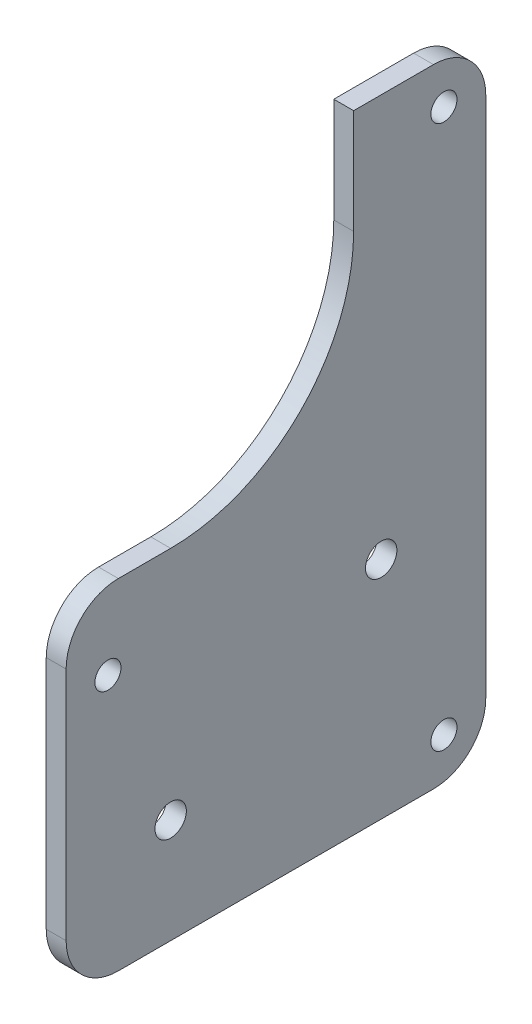
ISO-10303-21;
HEADER;
FILE_DESCRIPTION(('STEP AP214'),'2;1');
FILE_NAME('part.step','',(''),(''),'','','');
FILE_SCHEMA(('AUTOMOTIVE_DESIGN { 1 0 10303 214 1 1 1 1 }'));
ENDSEC;
DATA;
#1=APPLICATION_CONTEXT('core data for automotive mechanical design processes');
#2=APPLICATION_PROTOCOL_DEFINITION('international standard','automotive_design',2000,#1);
#3=PRODUCT_CONTEXT('',#1,'mechanical');
#4=PRODUCT('Part','Part','',(#3));
#5=PRODUCT_RELATED_PRODUCT_CATEGORY('part','',(#4));
#6=PRODUCT_DEFINITION_FORMATION('','',#4);
#7=PRODUCT_DEFINITION_CONTEXT('part definition',#1,'design');
#8=PRODUCT_DEFINITION('design','',#6,#7);
#9=PRODUCT_DEFINITION_SHAPE('','',#8);
#10=(LENGTH_UNIT() NAMED_UNIT(*) SI_UNIT(.MILLI.,.METRE.));
#11=(NAMED_UNIT(*) PLANE_ANGLE_UNIT() SI_UNIT($,.RADIAN.));
#12=(NAMED_UNIT(*) SI_UNIT($,.STERADIAN.) SOLID_ANGLE_UNIT());
#13=UNCERTAINTY_MEASURE_WITH_UNIT(LENGTH_MEASURE(1.E-05),#10,'distance_accuracy_value','');
#14=(GEOMETRIC_REPRESENTATION_CONTEXT(3) GLOBAL_UNCERTAINTY_ASSIGNED_CONTEXT((#13)) GLOBAL_UNIT_ASSIGNED_CONTEXT((#10,
#11,#12)) REPRESENTATION_CONTEXT('',''));
#15=CARTESIAN_POINT('',(0.,0.,0.));
#16=DIRECTION('',(0.,0.,1.));
#17=DIRECTION('',(1.,0.,0.));
#18=AXIS2_PLACEMENT_3D('',#15,#16,#17);
#19=CARTESIAN_POINT('',(3.8,29.375,13.7600877351087));
#20=DIRECTION('',(1.,0.,0.));
#21=DIRECTION('',(0.,0.,-1.));
#22=AXIS2_PLACEMENT_3D('',#19,#20,#21);
#23=PLANE('',#22);
#24=CARTESIAN_POINT('',(3.8,-62.625,-38.5100877351087));
#25=DIRECTION('',(1.,0.,0.));
#26=DIRECTION('',(0.,0.,1.));
#27=AXIS2_PLACEMENT_3D('',#24,#25,#26);
#28=CIRCLE('',#27,2.5);
#29=CARTESIAN_POINT('',(3.8,-62.625,-36.0100877351087));
#30=VERTEX_POINT('',#29);
#31=EDGE_CURVE('E251',#30,#30,#28,.T.);
#32=ORIENTED_EDGE('',*,*,#31,.F.);
#33=EDGE_LOOP('',(#32));
#34=FACE_BOUND('',#33,.T.);
#35=CARTESIAN_POINT('',(3.8,-27.575640625,-26.5100877351087));
#36=DIRECTION('',(1.,0.,0.));
#37=DIRECTION('',(0.,0.,-1.));
#38=AXIS2_PLACEMENT_3D('',#35,#36,#37);
#39=CIRCLE('',#38,3.);
#40=CARTESIAN_POINT('',(3.8,-27.575640625,-29.5100877351087));
#41=VERTEX_POINT('',#40);
#42=EDGE_CURVE('E239',#41,#41,#39,.T.);
#43=ORIENTED_EDGE('',*,*,#42,.F.);
#44=EDGE_LOOP('',(#43));
#45=FACE_BOUND('',#44,.T.);
#46=DIRECTION('',(0.,1.,0.));
#47=VECTOR('',#46,1.);
#48=CARTESIAN_POINT('',(3.8,49.375,-46.5100877351087));
#49=LINE('',#48,#47);
#50=CARTESIAN_POINT('',(3.8,-60.625,-46.5100877351087));
#51=VERTEX_POINT('',#50);
#52=CARTESIAN_POINT('',(3.8,39.375,-46.5100877351087));
#53=VERTEX_POINT('',#52);
#54=EDGE_CURVE('E128',#51,#53,#49,.T.);
#55=ORIENTED_EDGE('',*,*,#54,.T.);
#56=CARTESIAN_POINT('',(3.8,39.375,-36.5100877351087));
#57=DIRECTION('',(1.,0.,0.));
#58=DIRECTION('',(0.,0.,-1.));
#59=AXIS2_PLACEMENT_3D('',#56,#57,#58);
#60=CIRCLE('',#59,10.);
#61=CARTESIAN_POINT('',(3.8,49.375,-36.5100877351087));
#62=VERTEX_POINT('',#61);
#63=EDGE_CURVE('E124',#53,#62,#60,.T.);
#64=ORIENTED_EDGE('',*,*,#63,.T.);
#65=DIRECTION('',(0.,0.,1.));
#66=VECTOR('',#65,1.);
#67=CARTESIAN_POINT('',(3.8,49.375,-21.2399122648913));
#68=LINE('',#67,#66);
#69=CARTESIAN_POINT('',(3.8,49.375,-21.2399122648913));
#70=VERTEX_POINT('',#69);
#71=EDGE_CURVE('E116',#62,#70,#68,.T.);
#72=ORIENTED_EDGE('',*,*,#71,.T.);
#73=DIRECTION('',(0.,-1.,0.));
#74=VECTOR('',#73,1.);
#75=CARTESIAN_POINT('',(3.8,29.375,-21.2399122648913));
#76=LINE('',#75,#74);
#77=CARTESIAN_POINT('',(3.8,29.375,-21.2399122648913));
#78=VERTEX_POINT('',#77);
#79=EDGE_CURVE('E121',#70,#78,#76,.T.);
#80=ORIENTED_EDGE('',*,*,#79,.T.);
#81=CARTESIAN_POINT('',(3.8,29.375,13.7600877351087));
#82=DIRECTION('',(-1.,0.,0.));
#83=DIRECTION('',(0.,0.,-1.));
#84=AXIS2_PLACEMENT_3D('',#81,#82,#83);
#85=CIRCLE('',#84,35.);
#86=CARTESIAN_POINT('',(3.8,-5.62500000000001,13.7600877351087));
#87=VERTEX_POINT('',#86);
#88=EDGE_CURVE('E143',#78,#87,#85,.T.);
#89=ORIENTED_EDGE('',*,*,#88,.T.);
#90=DIRECTION('',(0.,0.,1.));
#91=VECTOR('',#90,1.);
#92=CARTESIAN_POINT('',(3.8,-5.62500000000001,13.7600877351087));
#93=LINE('',#92,#91);
#94=CARTESIAN_POINT('',(3.8,-5.625,23.7600877351087));
#95=VERTEX_POINT('',#94);
#96=EDGE_CURVE('E145',#87,#95,#93,.T.);
#97=ORIENTED_EDGE('',*,*,#96,.T.);
#98=CARTESIAN_POINT('',(3.8,-15.625,23.7600877351087));
#99=DIRECTION('',(1.,0.,0.));
#100=DIRECTION('',(0.,0.,-1.));
#101=AXIS2_PLACEMENT_3D('',#98,#99,#100);
#102=CIRCLE('',#101,10.);
#103=CARTESIAN_POINT('',(3.8,-15.625,33.7600877351087));
#104=VERTEX_POINT('',#103);
#105=EDGE_CURVE('E193',#95,#104,#102,.T.);
#106=ORIENTED_EDGE('',*,*,#105,.T.);
#107=DIRECTION('',(0.,-1.,0.));
#108=VECTOR('',#107,1.);
#109=CARTESIAN_POINT('',(3.8,-5.625,33.7600877351087));
#110=LINE('',#109,#108);
#111=CARTESIAN_POINT('',(3.8,-60.625,33.7600877351087));
#112=VERTEX_POINT('',#111);
#113=EDGE_CURVE('E151',#104,#112,#110,.T.);
#114=ORIENTED_EDGE('',*,*,#113,.T.);
#115=CARTESIAN_POINT('',(3.8,-60.625,23.7600877351087));
#116=DIRECTION('',(1.,0.,0.));
#117=DIRECTION('',(0.,0.,-1.));
#118=AXIS2_PLACEMENT_3D('',#115,#116,#117);
#119=CIRCLE('',#118,10.);
#120=CARTESIAN_POINT('',(3.8,-70.625,23.7600877351087));
#121=VERTEX_POINT('',#120);
#122=EDGE_CURVE('E55',#112,#121,#119,.T.);
#123=ORIENTED_EDGE('',*,*,#122,.T.);
#124=DIRECTION('',(0.,0.,-1.));
#125=VECTOR('',#124,1.);
#126=CARTESIAN_POINT('',(3.8,-70.625,33.7600877351087));
#127=LINE('',#126,#125);
#128=CARTESIAN_POINT('',(3.8,-70.625,-36.5100877351087));
#129=VERTEX_POINT('',#128);
#130=EDGE_CURVE('E153',#121,#129,#127,.T.);
#131=ORIENTED_EDGE('',*,*,#130,.T.);
#132=CARTESIAN_POINT('',(3.8,-60.625,-36.5100877351087));
#133=DIRECTION('',(1.,0.,0.));
#134=DIRECTION('',(0.,0.,-1.));
#135=AXIS2_PLACEMENT_3D('',#132,#133,#134);
#136=CIRCLE('',#135,10.);
#137=EDGE_CURVE('E190',#129,#51,#136,.T.);
#138=ORIENTED_EDGE('',*,*,#137,.T.);
#139=EDGE_LOOP('',(#55,#64,#72,#80,#89,#97,#106,#114,#123,#131,#138));
#140=FACE_BOUND('',#139,.T.);
#141=CARTESIAN_POINT('',(3.8,-50.625,13.7600877351087));
#142=DIRECTION('',(1.,0.,0.));
#143=DIRECTION('',(0.,0.,-1.));
#144=AXIS2_PLACEMENT_3D('',#141,#142,#143);
#145=CIRCLE('',#144,3.);
#146=CARTESIAN_POINT('',(3.8,-50.625,10.7600877351087));
#147=VERTEX_POINT('',#146);
#148=EDGE_CURVE('E159',#147,#147,#145,.T.);
#149=ORIENTED_EDGE('',*,*,#148,.F.);
#150=EDGE_LOOP('',(#149));
#151=FACE_BOUND('',#150,.T.);
#152=CARTESIAN_POINT('',(3.8,41.375,-38.5100877351087));
#153=DIRECTION('',(1.,0.,0.));
#154=DIRECTION('',(0.,0.,-1.));
#155=AXIS2_PLACEMENT_3D('',#152,#153,#154);
#156=CIRCLE('',#155,2.5);
#157=CARTESIAN_POINT('',(3.8,41.375,-41.0100877351087));
#158=VERTEX_POINT('',#157);
#159=EDGE_CURVE('E245',#158,#158,#156,.T.);
#160=ORIENTED_EDGE('',*,*,#159,.F.);
#161=EDGE_LOOP('',(#160));
#162=FACE_BOUND('',#161,.T.);
#163=CARTESIAN_POINT('',(3.8,-20.625,25.7600877351087));
#164=DIRECTION('',(1.,0.,0.));
#165=DIRECTION('',(0.,0.,-1.));
#166=AXIS2_PLACEMENT_3D('',#163,#164,#165);
#167=CIRCLE('',#166,2.5);
#168=CARTESIAN_POINT('',(3.8,-20.625,23.2600877351087));
#169=VERTEX_POINT('',#168);
#170=EDGE_CURVE('E257',#169,#169,#167,.T.);
#171=ORIENTED_EDGE('',*,*,#170,.F.);
#172=EDGE_LOOP('',(#171));
#173=FACE_BOUND('',#172,.T.);
#174=ADVANCED_FACE('F34',(#34,#45,#140,#151,#162,#173),#23,.T.);
#175=CARTESIAN_POINT('',(0.,29.375,13.7600877351087));
#176=DIRECTION('',(1.,0.,0.));
#177=DIRECTION('',(0.,0.,-1.));
#178=AXIS2_PLACEMENT_3D('',#175,#176,#177);
#179=PLANE('',#178);
#180=DIRECTION('',(0.,0.,1.));
#181=VECTOR('',#180,1.);
#182=CARTESIAN_POINT('',(0.,49.375,-21.2399122648913));
#183=LINE('',#182,#181);
#184=CARTESIAN_POINT('',(0.,49.375,-36.5100877351087));
#185=VERTEX_POINT('',#184);
#186=CARTESIAN_POINT('',(0.,49.375,-21.2399122648913));
#187=VERTEX_POINT('',#186);
#188=EDGE_CURVE('E134',#185,#187,#183,.T.);
#189=ORIENTED_EDGE('',*,*,#188,.F.);
#190=CARTESIAN_POINT('',(0.,39.375,-36.5100877351087));
#191=DIRECTION('',(1.,0.,0.));
#192=DIRECTION('',(0.,0.,-1.));
#193=AXIS2_PLACEMENT_3D('',#190,#191,#192);
#194=CIRCLE('',#193,10.);
#195=CARTESIAN_POINT('',(0.,39.375,-46.5100877351087));
#196=VERTEX_POINT('',#195);
#197=EDGE_CURVE('E183',#185,#196,#194,.F.);
#198=ORIENTED_EDGE('',*,*,#197,.T.);
#199=DIRECTION('',(0.,1.,0.));
#200=VECTOR('',#199,1.);
#201=CARTESIAN_POINT('',(0.,49.375,-46.5100877351087));
#202=LINE('',#201,#200);
#203=CARTESIAN_POINT('',(0.,-60.625,-46.5100877351087));
#204=VERTEX_POINT('',#203);
#205=EDGE_CURVE('E156',#204,#196,#202,.T.);
#206=ORIENTED_EDGE('',*,*,#205,.F.);
#207=CARTESIAN_POINT('',(0.,-60.625,-36.5100877351087));
#208=DIRECTION('',(1.,0.,0.));
#209=DIRECTION('',(0.,0.,-1.));
#210=AXIS2_PLACEMENT_3D('',#207,#208,#209);
#211=CIRCLE('',#210,10.);
#212=CARTESIAN_POINT('',(0.,-70.625,-36.5100877351087));
#213=VERTEX_POINT('',#212);
#214=EDGE_CURVE('E177',#204,#213,#211,.F.);
#215=ORIENTED_EDGE('',*,*,#214,.T.);
#216=DIRECTION('',(0.,0.,-1.));
#217=VECTOR('',#216,1.);
#218=CARTESIAN_POINT('',(0.,-70.625,33.7600877351087));
#219=LINE('',#218,#217);
#220=CARTESIAN_POINT('',(0.,-70.625,23.7600877351087));
#221=VERTEX_POINT('',#220);
#222=EDGE_CURVE('E171',#221,#213,#219,.T.);
#223=ORIENTED_EDGE('',*,*,#222,.F.);
#224=CARTESIAN_POINT('',(0.,-60.625,23.7600877351087));
#225=DIRECTION('',(1.,0.,0.));
#226=DIRECTION('',(0.,0.,-1.));
#227=AXIS2_PLACEMENT_3D('',#224,#225,#226);
#228=CIRCLE('',#227,10.);
#229=CARTESIAN_POINT('',(0.,-60.625,33.7600877351087));
#230=VERTEX_POINT('',#229);
#231=EDGE_CURVE('E179',#221,#230,#228,.F.);
#232=ORIENTED_EDGE('',*,*,#231,.T.);
#233=DIRECTION('',(0.,-1.,0.));
#234=VECTOR('',#233,1.);
#235=CARTESIAN_POINT('',(0.,-5.625,33.7600877351087));
#236=LINE('',#235,#234);
#237=CARTESIAN_POINT('',(0.,-15.625,33.7600877351087));
#238=VERTEX_POINT('',#237);
#239=EDGE_CURVE('E168',#238,#230,#236,.T.);
#240=ORIENTED_EDGE('',*,*,#239,.F.);
#241=CARTESIAN_POINT('',(0.,-15.625,23.7600877351087));
#242=DIRECTION('',(1.,0.,0.));
#243=DIRECTION('',(0.,0.,-1.));
#244=AXIS2_PLACEMENT_3D('',#241,#242,#243);
#245=CIRCLE('',#244,10.);
#246=CARTESIAN_POINT('',(0.,-5.625,23.7600877351087));
#247=VERTEX_POINT('',#246);
#248=EDGE_CURVE('E181',#238,#247,#245,.F.);
#249=ORIENTED_EDGE('',*,*,#248,.T.);
#250=DIRECTION('',(0.,0.,1.));
#251=VECTOR('',#250,1.);
#252=CARTESIAN_POINT('',(0.,-5.62500000000001,13.7600877351087));
#253=LINE('',#252,#251);
#254=CARTESIAN_POINT('',(0.,-5.62500000000001,13.7600877351087));
#255=VERTEX_POINT('',#254);
#256=EDGE_CURVE('E165',#255,#247,#253,.T.);
#257=ORIENTED_EDGE('',*,*,#256,.F.);
#258=CARTESIAN_POINT('',(0.,29.375,13.7600877351087));
#259=DIRECTION('',(-1.,0.,0.));
#260=DIRECTION('',(0.,0.,-1.));
#261=AXIS2_PLACEMENT_3D('',#258,#259,#260);
#262=CIRCLE('',#261,35.);
#263=CARTESIAN_POINT('',(0.,29.375,-21.2399122648913));
#264=VERTEX_POINT('',#263);
#265=EDGE_CURVE('E163',#264,#255,#262,.T.);
#266=ORIENTED_EDGE('',*,*,#265,.F.);
#267=DIRECTION('',(0.,-1.,0.));
#268=VECTOR('',#267,1.);
#269=CARTESIAN_POINT('',(0.,29.375,-21.2399122648913));
#270=LINE('',#269,#268);
#271=EDGE_CURVE('E161',#187,#264,#270,.T.);
#272=ORIENTED_EDGE('',*,*,#271,.F.);
#273=EDGE_LOOP('',(#189,#198,#206,#215,#223,#232,#240,#249,#257,#266,#272));
#274=FACE_BOUND('',#273,.T.);
#275=CARTESIAN_POINT('',(0.,-50.625,13.7600877351087));
#276=DIRECTION('',(1.,0.,0.));
#277=DIRECTION('',(0.,0.,-1.));
#278=AXIS2_PLACEMENT_3D('',#275,#276,#277);
#279=CIRCLE('',#278,3.);
#280=CARTESIAN_POINT('',(0.,-50.625,10.7600877351087));
#281=VERTEX_POINT('',#280);
#282=EDGE_CURVE('E236',#281,#281,#279,.T.);
#283=ORIENTED_EDGE('',*,*,#282,.T.);
#284=EDGE_LOOP('',(#283));
#285=FACE_BOUND('',#284,.T.);
#286=CARTESIAN_POINT('',(0.,-27.575640625,-26.5100877351087));
#287=DIRECTION('',(1.,0.,0.));
#288=DIRECTION('',(0.,0.,-1.));
#289=AXIS2_PLACEMENT_3D('',#286,#287,#288);
#290=CIRCLE('',#289,3.);
#291=CARTESIAN_POINT('',(0.,-27.575640625,-29.5100877351087));
#292=VERTEX_POINT('',#291);
#293=EDGE_CURVE('E242',#292,#292,#290,.T.);
#294=ORIENTED_EDGE('',*,*,#293,.T.);
#295=EDGE_LOOP('',(#294));
#296=FACE_BOUND('',#295,.T.);
#297=CARTESIAN_POINT('',(0.,41.375,-38.5100877351087));
#298=DIRECTION('',(1.,0.,0.));
#299=DIRECTION('',(0.,0.,-1.));
#300=AXIS2_PLACEMENT_3D('',#297,#298,#299);
#301=CIRCLE('',#300,2.5);
#302=CARTESIAN_POINT('',(0.,41.375,-41.0100877351087));
#303=VERTEX_POINT('',#302);
#304=EDGE_CURVE('E248',#303,#303,#301,.T.);
#305=ORIENTED_EDGE('',*,*,#304,.T.);
#306=EDGE_LOOP('',(#305));
#307=FACE_BOUND('',#306,.T.);
#308=CARTESIAN_POINT('',(0.,-62.625,-38.5100877351087));
#309=DIRECTION('',(1.,0.,0.));
#310=DIRECTION('',(0.,0.,1.));
#311=AXIS2_PLACEMENT_3D('',#308,#309,#310);
#312=CIRCLE('',#311,2.5);
#313=CARTESIAN_POINT('',(0.,-62.625,-36.0100877351087));
#314=VERTEX_POINT('',#313);
#315=EDGE_CURVE('E254',#314,#314,#312,.T.);
#316=ORIENTED_EDGE('',*,*,#315,.T.);
#317=EDGE_LOOP('',(#316));
#318=FACE_BOUND('',#317,.T.);
#319=CARTESIAN_POINT('',(0.,-20.625,25.7600877351087));
#320=DIRECTION('',(1.,0.,0.));
#321=DIRECTION('',(0.,0.,-1.));
#322=AXIS2_PLACEMENT_3D('',#319,#320,#321);
#323=CIRCLE('',#322,2.5);
#324=CARTESIAN_POINT('',(0.,-20.625,23.2600877351087));
#325=VERTEX_POINT('',#324);
#326=EDGE_CURVE('E260',#325,#325,#323,.T.);
#327=ORIENTED_EDGE('',*,*,#326,.T.);
#328=EDGE_LOOP('',(#327));
#329=FACE_BOUND('',#328,.T.);
#330=ADVANCED_FACE('F218',(#274,#285,#296,#307,#318,#329),#179,.F.);
#331=CARTESIAN_POINT('',(3.8,49.375,-46.5100877351087));
#332=DIRECTION('',(0.,0.,1.));
#333=DIRECTION('',(0.,-1.,0.));
#334=AXIS2_PLACEMENT_3D('',#331,#332,#333);
#335=PLANE('',#334);
#336=ORIENTED_EDGE('',*,*,#205,.T.);
#337=DIRECTION('',(-1.,0.,0.));
#338=VECTOR('',#337,1.);
#339=CARTESIAN_POINT('',(3.8,39.375,-46.5100877351087));
#340=LINE('',#339,#338);
#341=EDGE_CURVE('E188',#196,#53,#340,.F.);
#342=ORIENTED_EDGE('',*,*,#341,.T.);
#343=ORIENTED_EDGE('',*,*,#54,.F.);
#344=DIRECTION('',(-1.,0.,0.));
#345=VECTOR('',#344,1.);
#346=CARTESIAN_POINT('',(3.8,-60.625,-46.5100877351087));
#347=LINE('',#346,#345);
#348=EDGE_CURVE('E185',#51,#204,#347,.T.);
#349=ORIENTED_EDGE('',*,*,#348,.T.);
#350=EDGE_LOOP('',(#336,#342,#343,#349));
#351=FACE_BOUND('',#350,.T.);
#352=ADVANCED_FACE('F231',(#351),#335,.F.);
#353=CARTESIAN_POINT('',(3.8,49.375,-21.2399122648913));
#354=DIRECTION('',(0.,-1.,0.));
#355=DIRECTION('',(0.,0.,-1.));
#356=AXIS2_PLACEMENT_3D('',#353,#354,#355);
#357=PLANE('',#356);
#358=ORIENTED_EDGE('',*,*,#71,.F.);
#359=DIRECTION('',(-1.,0.,0.));
#360=VECTOR('',#359,1.);
#361=CARTESIAN_POINT('',(3.8,49.375,-36.5100877351087));
#362=LINE('',#361,#360);
#363=EDGE_CURVE('E137',#62,#185,#362,.T.);
#364=ORIENTED_EDGE('',*,*,#363,.T.);
#365=ORIENTED_EDGE('',*,*,#188,.T.);
#366=DIRECTION('',(-1.,0.,0.));
#367=VECTOR('',#366,1.);
#368=CARTESIAN_POINT('',(3.8,49.375,-21.2399122648913));
#369=LINE('',#368,#367);
#370=EDGE_CURVE('E131',#70,#187,#369,.T.);
#371=ORIENTED_EDGE('',*,*,#370,.F.);
#372=EDGE_LOOP('',(#358,#364,#365,#371));
#373=FACE_BOUND('',#372,.T.);
#374=ADVANCED_FACE('F132',(#373),#357,.F.);
#375=CARTESIAN_POINT('',(3.8,29.375,-21.2399122648913));
#376=DIRECTION('',(0.,0.,-1.));
#377=DIRECTION('',(0.,1.,0.));
#378=AXIS2_PLACEMENT_3D('',#375,#376,#377);
#379=PLANE('',#378);
#380=ORIENTED_EDGE('',*,*,#271,.T.);
#381=DIRECTION('',(-1.,0.,0.));
#382=VECTOR('',#381,1.);
#383=CARTESIAN_POINT('',(3.8,29.375,-21.2399122648913));
#384=LINE('',#383,#382);
#385=EDGE_CURVE('E138',#78,#264,#384,.T.);
#386=ORIENTED_EDGE('',*,*,#385,.F.);
#387=ORIENTED_EDGE('',*,*,#79,.F.);
#388=ORIENTED_EDGE('',*,*,#370,.T.);
#389=EDGE_LOOP('',(#380,#386,#387,#388));
#390=FACE_BOUND('',#389,.T.);
#391=ADVANCED_FACE('F140',(#390),#379,.F.);
#392=CARTESIAN_POINT('',(3.8,29.375,13.7600877351087));
#393=DIRECTION('',(-1.,0.,0.));
#394=DIRECTION('',(0.,0.,1.));
#395=AXIS2_PLACEMENT_3D('',#392,#393,#394);
#396=CYLINDRICAL_SURFACE('',#395,35.);
#397=ORIENTED_EDGE('',*,*,#265,.T.);
#398=DIRECTION('',(-1.,0.,0.));
#399=VECTOR('',#398,1.);
#400=CARTESIAN_POINT('',(3.8,-5.62500000000001,13.7600877351087));
#401=LINE('',#400,#399);
#402=EDGE_CURVE('E155',#87,#255,#401,.T.);
#403=ORIENTED_EDGE('',*,*,#402,.F.);
#404=ORIENTED_EDGE('',*,*,#88,.F.);
#405=ORIENTED_EDGE('',*,*,#385,.T.);
#406=EDGE_LOOP('',(#397,#403,#404,#405));
#407=FACE_BOUND('',#406,.T.);
#408=ADVANCED_FACE('F288',(#407),#396,.F.);
#409=CARTESIAN_POINT('',(3.8,-5.62500000000001,13.7600877351087));
#410=DIRECTION('',(0.,-1.,0.));
#411=DIRECTION('',(0.,0.,-1.));
#412=AXIS2_PLACEMENT_3D('',#409,#410,#411);
#413=PLANE('',#412);
#414=ORIENTED_EDGE('',*,*,#256,.T.);
#415=DIRECTION('',(-1.,0.,0.));
#416=VECTOR('',#415,1.);
#417=CARTESIAN_POINT('',(3.8,-5.625,23.7600877351087));
#418=LINE('',#417,#416);
#419=EDGE_CURVE('E201',#247,#95,#418,.F.);
#420=ORIENTED_EDGE('',*,*,#419,.T.);
#421=ORIENTED_EDGE('',*,*,#96,.F.);
#422=ORIENTED_EDGE('',*,*,#402,.T.);
#423=EDGE_LOOP('',(#414,#420,#421,#422));
#424=FACE_BOUND('',#423,.T.);
#425=ADVANCED_FACE('F205',(#424),#413,.F.);
#426=CARTESIAN_POINT('',(3.8,-5.625,33.7600877351087));
#427=DIRECTION('',(0.,0.,-1.));
#428=DIRECTION('',(0.,1.,0.));
#429=AXIS2_PLACEMENT_3D('',#426,#427,#428);
#430=PLANE('',#429);
#431=ORIENTED_EDGE('',*,*,#113,.F.);
#432=DIRECTION('',(-1.,0.,0.));
#433=VECTOR('',#432,1.);
#434=CARTESIAN_POINT('',(3.8,-15.625,33.7600877351087));
#435=LINE('',#434,#433);
#436=EDGE_CURVE('E198',#104,#238,#435,.T.);
#437=ORIENTED_EDGE('',*,*,#436,.T.);
#438=ORIENTED_EDGE('',*,*,#239,.T.);
#439=DIRECTION('',(-1.,0.,0.));
#440=VECTOR('',#439,1.);
#441=CARTESIAN_POINT('',(3.8,-60.625,33.7600877351087));
#442=LINE('',#441,#440);
#443=EDGE_CURVE('E196',#230,#112,#442,.F.);
#444=ORIENTED_EDGE('',*,*,#443,.T.);
#445=EDGE_LOOP('',(#431,#437,#438,#444));
#446=FACE_BOUND('',#445,.T.);
#447=ADVANCED_FACE('F215',(#446),#430,.F.);
#448=CARTESIAN_POINT('',(3.8,-70.625,33.7600877351087));
#449=DIRECTION('',(0.,1.,0.));
#450=DIRECTION('',(0.,0.,1.));
#451=AXIS2_PLACEMENT_3D('',#448,#449,#450);
#452=PLANE('',#451);
#453=ORIENTED_EDGE('',*,*,#130,.F.);
#454=DIRECTION('',(-1.,0.,0.));
#455=VECTOR('',#454,1.);
#456=CARTESIAN_POINT('',(3.8,-70.625,23.7600877351087));
#457=LINE('',#456,#455);
#458=EDGE_CURVE('E11',#121,#221,#457,.T.);
#459=ORIENTED_EDGE('',*,*,#458,.T.);
#460=ORIENTED_EDGE('',*,*,#222,.T.);
#461=DIRECTION('',(-1.,0.,0.));
#462=VECTOR('',#461,1.);
#463=CARTESIAN_POINT('',(3.8,-70.625,-36.5100877351087));
#464=LINE('',#463,#462);
#465=EDGE_CURVE('E42',#213,#129,#464,.F.);
#466=ORIENTED_EDGE('',*,*,#465,.T.);
#467=EDGE_LOOP('',(#453,#459,#460,#466));
#468=FACE_BOUND('',#467,.T.);
#469=ADVANCED_FACE('F224',(#468),#452,.F.);
#470=CARTESIAN_POINT('',(3.8,-50.625,13.7600877351087));
#471=DIRECTION('',(-1.,0.,0.));
#472=DIRECTION('',(0.,0.,1.));
#473=AXIS2_PLACEMENT_3D('',#470,#471,#472);
#474=CYLINDRICAL_SURFACE('',#473,3.);
#475=ORIENTED_EDGE('',*,*,#148,.T.);
#476=EDGE_LOOP('',(#475));
#477=FACE_BOUND('',#476,.T.);
#478=ORIENTED_EDGE('',*,*,#282,.F.);
#479=EDGE_LOOP('',(#478));
#480=FACE_BOUND('',#479,.T.);
#481=ADVANCED_FACE('F279',(#477,#480),#474,.F.);
#482=CARTESIAN_POINT('',(3.8,-27.575640625,-26.5100877351087));
#483=DIRECTION('',(-1.,0.,0.));
#484=DIRECTION('',(0.,0.,1.));
#485=AXIS2_PLACEMENT_3D('',#482,#483,#484);
#486=CYLINDRICAL_SURFACE('',#485,3.);
#487=ORIENTED_EDGE('',*,*,#42,.T.);
#488=EDGE_LOOP('',(#487));
#489=FACE_BOUND('',#488,.T.);
#490=ORIENTED_EDGE('',*,*,#293,.F.);
#491=EDGE_LOOP('',(#490));
#492=FACE_BOUND('',#491,.T.);
#493=ADVANCED_FACE('F395',(#489,#492),#486,.F.);
#494=CARTESIAN_POINT('',(3.8,41.375,-38.5100877351087));
#495=DIRECTION('',(-1.,0.,0.));
#496=DIRECTION('',(0.,0.,1.));
#497=AXIS2_PLACEMENT_3D('',#494,#495,#496);
#498=CYLINDRICAL_SURFACE('',#497,2.5);
#499=ORIENTED_EDGE('',*,*,#159,.T.);
#500=EDGE_LOOP('',(#499));
#501=FACE_BOUND('',#500,.T.);
#502=ORIENTED_EDGE('',*,*,#304,.F.);
#503=EDGE_LOOP('',(#502));
#504=FACE_BOUND('',#503,.T.);
#505=ADVANCED_FACE('F385',(#501,#504),#498,.F.);
#506=CARTESIAN_POINT('',(3.8,-62.625,-38.5100877351087));
#507=DIRECTION('',(-1.,0.,0.));
#508=DIRECTION('',(0.,0.,1.));
#509=AXIS2_PLACEMENT_3D('',#506,#507,#508);
#510=CYLINDRICAL_SURFACE('',#509,2.5);
#511=ORIENTED_EDGE('',*,*,#31,.T.);
#512=EDGE_LOOP('',(#511));
#513=FACE_BOUND('',#512,.T.);
#514=ORIENTED_EDGE('',*,*,#315,.F.);
#515=EDGE_LOOP('',(#514));
#516=FACE_BOUND('',#515,.T.);
#517=ADVANCED_FACE('F376',(#513,#516),#510,.F.);
#518=CARTESIAN_POINT('',(3.8,-20.625,25.7600877351087));
#519=DIRECTION('',(-1.,0.,0.));
#520=DIRECTION('',(0.,0.,1.));
#521=AXIS2_PLACEMENT_3D('',#518,#519,#520);
#522=CYLINDRICAL_SURFACE('',#521,2.5);
#523=ORIENTED_EDGE('',*,*,#170,.T.);
#524=EDGE_LOOP('',(#523));
#525=FACE_BOUND('',#524,.T.);
#526=ORIENTED_EDGE('',*,*,#326,.F.);
#527=EDGE_LOOP('',(#526));
#528=FACE_BOUND('',#527,.T.);
#529=ADVANCED_FACE('F266',(#525,#528),#522,.F.);
#530=CARTESIAN_POINT('',(3.8,39.375,-36.5100877351087));
#531=DIRECTION('',(-1.,0.,0.));
#532=DIRECTION('',(0.,0.,1.));
#533=AXIS2_PLACEMENT_3D('',#530,#531,#532);
#534=CYLINDRICAL_SURFACE('',#533,10.);
#535=ORIENTED_EDGE('',*,*,#63,.F.);
#536=ORIENTED_EDGE('',*,*,#341,.F.);
#537=ORIENTED_EDGE('',*,*,#197,.F.);
#538=ORIENTED_EDGE('',*,*,#363,.F.);
#539=EDGE_LOOP('',(#535,#536,#537,#538));
#540=FACE_BOUND('',#539,.T.);
#541=ADVANCED_FACE('F234',(#540),#534,.T.);
#542=CARTESIAN_POINT('',(3.8,-15.625,23.7600877351087));
#543=DIRECTION('',(-1.,0.,0.));
#544=DIRECTION('',(0.,0.,1.));
#545=AXIS2_PLACEMENT_3D('',#542,#543,#544);
#546=CYLINDRICAL_SURFACE('',#545,10.);
#547=ORIENTED_EDGE('',*,*,#105,.F.);
#548=ORIENTED_EDGE('',*,*,#419,.F.);
#549=ORIENTED_EDGE('',*,*,#248,.F.);
#550=ORIENTED_EDGE('',*,*,#436,.F.);
#551=EDGE_LOOP('',(#547,#548,#549,#550));
#552=FACE_BOUND('',#551,.T.);
#553=ADVANCED_FACE('F212',(#552),#546,.T.);
#554=CARTESIAN_POINT('',(3.8,-60.625,23.7600877351087));
#555=DIRECTION('',(-1.,0.,0.));
#556=DIRECTION('',(0.,0.,1.));
#557=AXIS2_PLACEMENT_3D('',#554,#555,#556);
#558=CYLINDRICAL_SURFACE('',#557,10.);
#559=ORIENTED_EDGE('',*,*,#122,.F.);
#560=ORIENTED_EDGE('',*,*,#443,.F.);
#561=ORIENTED_EDGE('',*,*,#231,.F.);
#562=ORIENTED_EDGE('',*,*,#458,.F.);
#563=EDGE_LOOP('',(#559,#560,#561,#562));
#564=FACE_BOUND('',#563,.T.);
#565=ADVANCED_FACE('F223',(#564),#558,.T.);
#566=CARTESIAN_POINT('',(3.8,-60.625,-36.5100877351087));
#567=DIRECTION('',(-1.,0.,0.));
#568=DIRECTION('',(0.,0.,1.));
#569=AXIS2_PLACEMENT_3D('',#566,#567,#568);
#570=CYLINDRICAL_SURFACE('',#569,10.);
#571=ORIENTED_EDGE('',*,*,#137,.F.);
#572=ORIENTED_EDGE('',*,*,#465,.F.);
#573=ORIENTED_EDGE('',*,*,#214,.F.);
#574=ORIENTED_EDGE('',*,*,#348,.F.);
#575=EDGE_LOOP('',(#571,#572,#573,#574));
#576=FACE_BOUND('',#575,.T.);
#577=ADVANCED_FACE('F36',(#576),#570,.T.);
#578=CLOSED_SHELL('',(#174,#330,#352,#374,#391,#408,#425,#447,#469,#481,#493,#505,#517,#529,
#541,#553,#565,#577));
#579=MANIFOLD_SOLID_BREP('B2',#578);
#580=ADVANCED_BREP_SHAPE_REPRESENTATION('',(#18,#579),#14);
#581=SHAPE_DEFINITION_REPRESENTATION(#9,#580);
ENDSEC;
END-ISO-10303-21;
